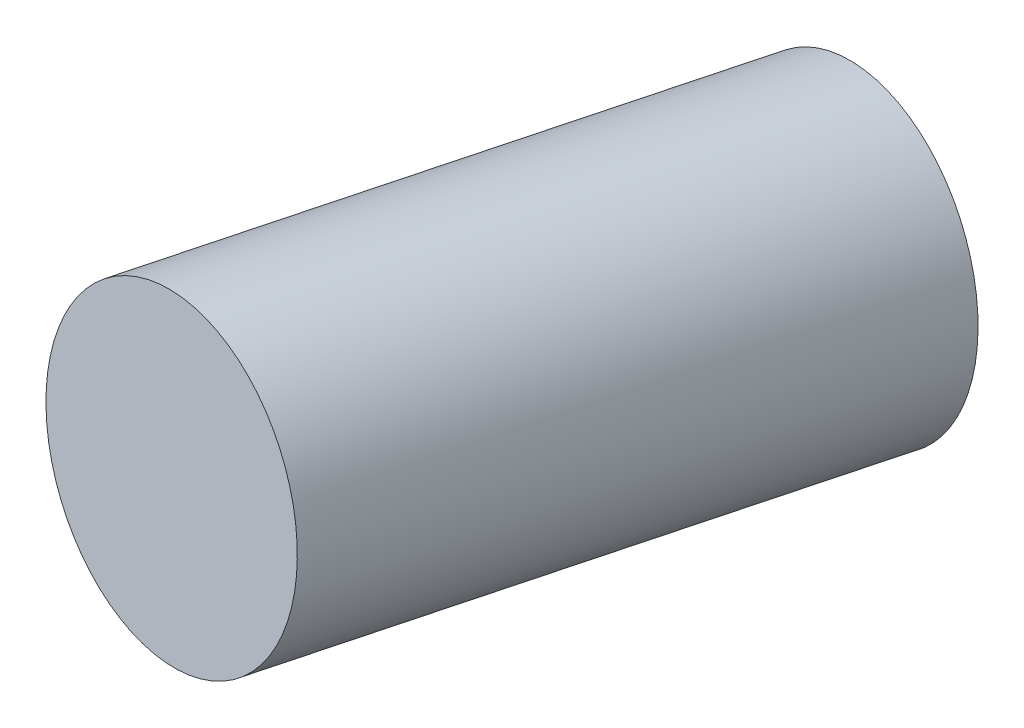
ISO-10303-21;
HEADER;
FILE_DESCRIPTION(('STEP AP214'),'2;1');
FILE_NAME('part.step','',(''),(''),'','','');
FILE_SCHEMA(('AUTOMOTIVE_DESIGN { 1 0 10303 214 1 1 1 1 }'));
ENDSEC;
DATA;
#1=APPLICATION_CONTEXT('core data for automotive mechanical design processes');
#2=APPLICATION_PROTOCOL_DEFINITION('international standard','automotive_design',2000,#1);
#3=PRODUCT_CONTEXT('',#1,'mechanical');
#4=PRODUCT('Part','Part','',(#3));
#5=PRODUCT_RELATED_PRODUCT_CATEGORY('part','',(#4));
#6=PRODUCT_DEFINITION_FORMATION('','',#4);
#7=PRODUCT_DEFINITION_CONTEXT('part definition',#1,'design');
#8=PRODUCT_DEFINITION('design','',#6,#7);
#9=PRODUCT_DEFINITION_SHAPE('','',#8);
#10=(LENGTH_UNIT() NAMED_UNIT(*) SI_UNIT(.MILLI.,.METRE.));
#11=(NAMED_UNIT(*) PLANE_ANGLE_UNIT() SI_UNIT($,.RADIAN.));
#12=(NAMED_UNIT(*) SI_UNIT($,.STERADIAN.) SOLID_ANGLE_UNIT());
#13=UNCERTAINTY_MEASURE_WITH_UNIT(LENGTH_MEASURE(1.E-05),#10,'distance_accuracy_value','');
#14=(GEOMETRIC_REPRESENTATION_CONTEXT(3) GLOBAL_UNCERTAINTY_ASSIGNED_CONTEXT((#13)) GLOBAL_UNIT_ASSIGNED_CONTEXT((#10,
#11,#12)) REPRESENTATION_CONTEXT('',''));
#15=CARTESIAN_POINT('',(0.,0.,0.));
#16=DIRECTION('',(0.,0.,1.));
#17=DIRECTION('',(1.,0.,0.));
#18=AXIS2_PLACEMENT_3D('',#15,#16,#17);
#19=CARTESIAN_POINT('',(9.62646498755642,-5.55784215191027,4.48352085995661));
#20=DIRECTION('',(0.150383733180432,-0.0868240888334644,-0.984807753012209));
#21=DIRECTION('',(0.852868531952441,-0.492403876506108,0.173648177666927));
#22=AXIS2_PLACEMENT_3D('',#19,#20,#21);
#23=PLANE('',#22);
#24=CARTESIAN_POINT('',(9.62646498755642,-5.55784215191027,4.48352085995661));
#25=DIRECTION('',(-0.150383733180432,0.0868240888334644,0.984807753012209));
#26=DIRECTION('',(-0.852868531952441,0.492403876506108,-0.173648177666927));
#27=AXIS2_PLACEMENT_3D('',#24,#25,#26);
#28=CIRCLE('',#27,1.93220030269667);
#29=CARTESIAN_POINT('',(7.97855215195745,-4.60641923267615,4.14799779850585));
#30=VERTEX_POINT('',#29);
#31=EDGE_CURVE('E10',#30,#30,#28,.T.);
#32=ORIENTED_EDGE('',*,*,#31,.T.);
#33=EDGE_LOOP('',(#32));
#34=FACE_BOUND('',#33,.T.);
#35=ADVANCED_FACE('F15',(#34),#23,.F.);
#36=CARTESIAN_POINT('',(9.46265533813223,-5.46326660671935,5.55625000000001));
#37=DIRECTION('',(-0.150383733180432,0.0868240888334644,0.984807753012209));
#38=DIRECTION('',(-0.852868531952441,0.492403876506108,-0.173648177666927));
#39=AXIS2_PLACEMENT_3D('',#36,#37,#38);
#40=CYLINDRICAL_SURFACE('',#39,1.93220030269667);
#41=ORIENTED_EDGE('',*,*,#31,.F.);
#42=EDGE_LOOP('',(#41));
#43=FACE_BOUND('',#42,.T.);
#44=CARTESIAN_POINT('',(10.7959490356234,-6.23304408187474,-3.175));
#45=DIRECTION('',(-0.150383733180432,0.0868240888334644,0.984807753012209));
#46=DIRECTION('',(-0.852868531952442,0.492403876506108,-0.173648177666927));
#47=AXIS2_PLACEMENT_3D('',#44,#45,#46);
#48=CIRCLE('',#47,1.93220030269668);
#49=CARTESIAN_POINT('',(9.14803620002442,-5.28162116264062,-3.51052306145076));
#50=VERTEX_POINT('',#49);
#51=EDGE_CURVE('E19',#50,#50,#48,.T.);
#52=ORIENTED_EDGE('',*,*,#51,.T.);
#53=EDGE_LOOP('',(#52));
#54=FACE_BOUND('',#53,.T.);
#55=ADVANCED_FACE('F28',(#43,#54),#40,.T.);
#56=CARTESIAN_POINT('',(12.4438618712224,-7.18446700110885,-2.83947693854923));
#57=DIRECTION('',(-0.150383733180432,0.0868240888334644,0.984807753012209));
#58=DIRECTION('',(-0.852868531952441,0.492403876506108,-0.173648177666927));
#59=AXIS2_PLACEMENT_3D('',#56,#57,#58);
#60=PLANE('',#59);
#61=ORIENTED_EDGE('',*,*,#51,.F.);
#62=EDGE_LOOP('',(#61));
#63=FACE_BOUND('',#62,.T.);
#64=ADVANCED_FACE('F17',(#63),#60,.F.);
#65=CLOSED_SHELL('',(#35,#55,#64));
#66=MANIFOLD_SOLID_BREP('B1',#65);
#67=ADVANCED_BREP_SHAPE_REPRESENTATION('',(#18,#66),#14);
#68=SHAPE_DEFINITION_REPRESENTATION(#9,#67);
ENDSEC;
END-ISO-10303-21;
